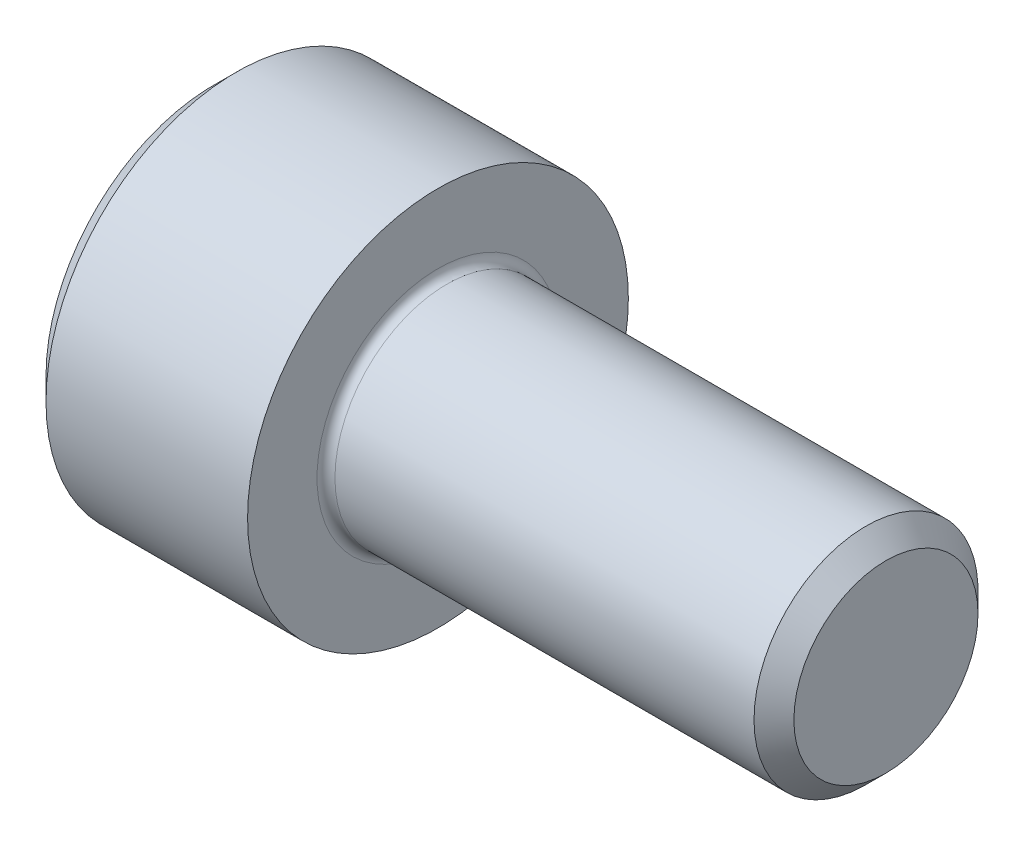
ISO-10303-21;
HEADER;
FILE_DESCRIPTION(('STEP AP214'),'2;1');
FILE_NAME('part.step','',(''),(''),'','','');
FILE_SCHEMA(('AUTOMOTIVE_DESIGN { 1 0 10303 214 1 1 1 1 }'));
ENDSEC;
DATA;
#1=APPLICATION_CONTEXT('core data for automotive mechanical design processes');
#2=APPLICATION_PROTOCOL_DEFINITION('international standard','automotive_design',2000,#1);
#3=PRODUCT_CONTEXT('',#1,'mechanical');
#4=PRODUCT('Part','Part','',(#3));
#5=PRODUCT_RELATED_PRODUCT_CATEGORY('part','',(#4));
#6=PRODUCT_DEFINITION_FORMATION('','',#4);
#7=PRODUCT_DEFINITION_CONTEXT('part definition',#1,'design');
#8=PRODUCT_DEFINITION('design','',#6,#7);
#9=PRODUCT_DEFINITION_SHAPE('','',#8);
#10=(LENGTH_UNIT() NAMED_UNIT(*) SI_UNIT(.MILLI.,.METRE.));
#11=(NAMED_UNIT(*) PLANE_ANGLE_UNIT() SI_UNIT($,.RADIAN.));
#12=(NAMED_UNIT(*) SI_UNIT($,.STERADIAN.) SOLID_ANGLE_UNIT());
#13=UNCERTAINTY_MEASURE_WITH_UNIT(LENGTH_MEASURE(1.E-05),#10,'distance_accuracy_value','');
#14=(GEOMETRIC_REPRESENTATION_CONTEXT(3) GLOBAL_UNCERTAINTY_ASSIGNED_CONTEXT((#13)) GLOBAL_UNIT_ASSIGNED_CONTEXT((#10,
#11,#12)) REPRESENTATION_CONTEXT('',''));
#15=CARTESIAN_POINT('',(0.,0.,0.));
#16=DIRECTION('',(0.,0.,1.));
#17=DIRECTION('',(1.,0.,0.));
#18=AXIS2_PLACEMENT_3D('',#15,#16,#17);
#19=CARTESIAN_POINT('',(0.,0.,0.));
#20=DIRECTION('',(-1.,0.,0.));
#21=DIRECTION('',(0.,0.,1.));
#22=AXIS2_PLACEMENT_3D('',#19,#20,#21);
#23=PLANE('',#22);
#24=DIRECTION('',(0.,-0.5,0.866025403784438));
#25=VECTOR('',#24,1.);
#26=CARTESIAN_POINT('',(0.,2.35789849937043,0.));
#27=LINE('',#26,#25);
#28=CARTESIAN_POINT('',(0.,2.35789849937043,0.));
#29=VERTEX_POINT('',#28);
#30=CARTESIAN_POINT('',(0.,1.17894924968521,2.042));
#31=VERTEX_POINT('',#30);
#32=EDGE_CURVE('E262',#29,#31,#27,.T.);
#33=ORIENTED_EDGE('',*,*,#32,.T.);
#34=DIRECTION('',(0.,1.,0.));
#35=VECTOR('',#34,1.);
#36=CARTESIAN_POINT('',(0.,-1.17894924968522,2.042));
#37=LINE('',#36,#35);
#38=CARTESIAN_POINT('',(0.,-1.17894924968522,2.042));
#39=VERTEX_POINT('',#38);
#40=EDGE_CURVE('E133',#39,#31,#37,.T.);
#41=ORIENTED_EDGE('',*,*,#40,.F.);
#42=DIRECTION('',(0.,-0.500000000000001,-0.866025403784438));
#43=VECTOR('',#42,1.);
#44=CARTESIAN_POINT('',(0.,-1.17894924968522,2.042));
#45=LINE('',#44,#43);
#46=CARTESIAN_POINT('',(0.,-2.35789849937044,0.));
#47=VERTEX_POINT('',#46);
#48=EDGE_CURVE('E265',#39,#47,#45,.T.);
#49=ORIENTED_EDGE('',*,*,#48,.T.);
#50=DIRECTION('',(0.,0.5,-0.866025403784439));
#51=VECTOR('',#50,1.);
#52=CARTESIAN_POINT('',(0.,-2.35789849937044,0.));
#53=LINE('',#52,#51);
#54=CARTESIAN_POINT('',(0.,-1.17894924968522,-2.042));
#55=VERTEX_POINT('',#54);
#56=EDGE_CURVE('E268',#47,#55,#53,.T.);
#57=ORIENTED_EDGE('',*,*,#56,.T.);
#58=DIRECTION('',(0.,-1.,0.));
#59=VECTOR('',#58,1.);
#60=CARTESIAN_POINT('',(0.,1.17894924968521,-2.042));
#61=LINE('',#60,#59);
#62=CARTESIAN_POINT('',(0.,1.17894924968521,-2.042));
#63=VERTEX_POINT('',#62);
#64=EDGE_CURVE('E271',#63,#55,#61,.T.);
#65=ORIENTED_EDGE('',*,*,#64,.F.);
#66=DIRECTION('',(0.,-0.500000000000001,-0.866025403784438));
#67=VECTOR('',#66,1.);
#68=CARTESIAN_POINT('',(0.,2.35789849937043,0.));
#69=LINE('',#68,#67);
#70=EDGE_CURVE('E128',#29,#63,#69,.T.);
#71=ORIENTED_EDGE('',*,*,#70,.F.);
#72=EDGE_LOOP('',(#33,#41,#49,#57,#65,#71));
#73=FACE_BOUND('',#72,.T.);
#74=CARTESIAN_POINT('',(0.,0.,0.));
#75=DIRECTION('',(-1.,0.,0.));
#76=DIRECTION('',(0.,0.,1.));
#77=AXIS2_PLACEMENT_3D('',#74,#75,#76);
#78=CIRCLE('',#77,3.75);
#79=CARTESIAN_POINT('',(0.,0.,3.75));
#80=VERTEX_POINT('',#79);
#81=EDGE_CURVE('E157',#80,#80,#78,.T.);
#82=ORIENTED_EDGE('',*,*,#81,.T.);
#83=EDGE_LOOP('',(#82));
#84=FACE_BOUND('',#83,.T.);
#85=ADVANCED_FACE('F37',(#73,#84),#23,.T.);
#86=CARTESIAN_POINT('',(0.,0.,0.));
#87=DIRECTION('',(1.,0.,0.));
#88=DIRECTION('',(0.,0.,-1.));
#89=AXIS2_PLACEMENT_3D('',#86,#87,#88);
#90=CONICAL_SURFACE('',#89,3.75,0.785398163397449);
#91=CARTESIAN_POINT('',(0.5,0.,0.));
#92=DIRECTION('',(-1.,0.,0.));
#93=DIRECTION('',(0.,0.,1.));
#94=AXIS2_PLACEMENT_3D('',#91,#92,#93);
#95=CIRCLE('',#94,4.25);
#96=CARTESIAN_POINT('',(0.5,0.,4.25));
#97=VERTEX_POINT('',#96);
#98=EDGE_CURVE('E154',#97,#97,#95,.T.);
#99=ORIENTED_EDGE('',*,*,#98,.T.);
#100=EDGE_LOOP('',(#99));
#101=FACE_BOUND('',#100,.T.);
#102=ORIENTED_EDGE('',*,*,#81,.F.);
#103=EDGE_LOOP('',(#102));
#104=FACE_BOUND('',#103,.T.);
#105=ADVANCED_FACE('F178',(#101,#104),#90,.T.);
#106=CARTESIAN_POINT('',(-31.75,0.,0.));
#107=DIRECTION('',(-1.,0.,0.));
#108=DIRECTION('',(0.,0.,1.));
#109=AXIS2_PLACEMENT_3D('',#106,#107,#108);
#110=CYLINDRICAL_SURFACE('',#109,4.25);
#111=CARTESIAN_POINT('',(5.,0.,0.));
#112=DIRECTION('',(-1.,0.,0.));
#113=DIRECTION('',(0.,0.,1.));
#114=AXIS2_PLACEMENT_3D('',#111,#112,#113);
#115=CIRCLE('',#114,4.25);
#116=CARTESIAN_POINT('',(5.,0.,4.25));
#117=VERTEX_POINT('',#116);
#118=EDGE_CURVE('E151',#117,#117,#115,.T.);
#119=ORIENTED_EDGE('',*,*,#118,.T.);
#120=EDGE_LOOP('',(#119));
#121=FACE_BOUND('',#120,.T.);
#122=ORIENTED_EDGE('',*,*,#98,.F.);
#123=EDGE_LOOP('',(#122));
#124=FACE_BOUND('',#123,.T.);
#125=ADVANCED_FACE('F183',(#121,#124),#110,.T.);
#126=CARTESIAN_POINT('',(5.,4.25,0.));
#127=DIRECTION('',(1.,0.,0.));
#128=DIRECTION('',(0.,0.,-1.));
#129=AXIS2_PLACEMENT_3D('',#126,#127,#128);
#130=PLANE('',#129);
#131=CARTESIAN_POINT('',(5.,0.,0.));
#132=DIRECTION('',(1.,0.,0.));
#133=DIRECTION('',(0.,0.,-1.));
#134=AXIS2_PLACEMENT_3D('',#131,#132,#133);
#135=CIRCLE('',#134,2.69999999999997);
#136=CARTESIAN_POINT('',(5.,0.,-2.69999999999997));
#137=VERTEX_POINT('',#136);
#138=EDGE_CURVE('E45',#137,#137,#135,.F.);
#139=ORIENTED_EDGE('',*,*,#138,.T.);
#140=EDGE_LOOP('',(#139));
#141=FACE_BOUND('',#140,.T.);
#142=ORIENTED_EDGE('',*,*,#118,.F.);
#143=EDGE_LOOP('',(#142));
#144=FACE_BOUND('',#143,.T.);
#145=ADVANCED_FACE('F162',(#141,#144),#130,.T.);
#146=CARTESIAN_POINT('',(-31.75,0.,0.));
#147=DIRECTION('',(-1.,0.,0.));
#148=DIRECTION('',(0.,0.,1.));
#149=AXIS2_PLACEMENT_3D('',#146,#147,#148);
#150=CYLINDRICAL_SURFACE('',#149,2.49999999999996);
#151=CARTESIAN_POINT('',(5.2,0.,0.));
#152=DIRECTION('',(1.,0.,0.));
#153=DIRECTION('',(0.,0.,-1.));
#154=AXIS2_PLACEMENT_3D('',#151,#152,#153);
#155=CIRCLE('',#154,2.49999999999996);
#156=CARTESIAN_POINT('',(5.2,0.,-2.49999999999996));
#157=VERTEX_POINT('',#156);
#158=EDGE_CURVE('E11',#157,#157,#155,.T.);
#159=ORIENTED_EDGE('',*,*,#158,.T.);
#160=EDGE_LOOP('',(#159));
#161=FACE_BOUND('',#160,.T.);
#162=CARTESIAN_POINT('',(14.5549999999999,0.,0.));
#163=DIRECTION('',(-1.,0.,0.));
#164=DIRECTION('',(0.,0.,1.));
#165=AXIS2_PLACEMENT_3D('',#162,#163,#164);
#166=CIRCLE('',#165,2.49999999999993);
#167=CARTESIAN_POINT('',(14.5549999999999,0.,2.49999999999993));
#168=VERTEX_POINT('',#167);
#169=EDGE_CURVE('E148',#168,#168,#166,.T.);
#170=ORIENTED_EDGE('',*,*,#169,.T.);
#171=EDGE_LOOP('',(#170));
#172=FACE_BOUND('',#171,.T.);
#173=ADVANCED_FACE('F193',(#161,#172),#150,.T.);
#174=CARTESIAN_POINT('',(15.,0.,0.));
#175=DIRECTION('',(-1.,0.,0.));
#176=DIRECTION('',(0.,0.,1.));
#177=AXIS2_PLACEMENT_3D('',#174,#175,#176);
#178=CONICAL_SURFACE('',#177,2.055,0.785398163397306);
#179=ORIENTED_EDGE('',*,*,#169,.F.);
#180=EDGE_LOOP('',(#179));
#181=FACE_BOUND('',#180,.T.);
#182=CARTESIAN_POINT('',(15.,0.,0.));
#183=DIRECTION('',(-1.,0.,0.));
#184=DIRECTION('',(0.,0.,1.));
#185=AXIS2_PLACEMENT_3D('',#182,#183,#184);
#186=CIRCLE('',#185,2.055);
#187=CARTESIAN_POINT('',(15.,0.,2.055));
#188=VERTEX_POINT('',#187);
#189=EDGE_CURVE('E144',#188,#188,#186,.T.);
#190=ORIENTED_EDGE('',*,*,#189,.T.);
#191=EDGE_LOOP('',(#190));
#192=FACE_BOUND('',#191,.T.);
#193=ADVANCED_FACE('F173',(#181,#192),#178,.T.);
#194=CARTESIAN_POINT('',(15.,2.055,0.));
#195=DIRECTION('',(1.,0.,0.));
#196=DIRECTION('',(0.,0.,-1.));
#197=AXIS2_PLACEMENT_3D('',#194,#195,#196);
#198=PLANE('',#197);
#199=ORIENTED_EDGE('',*,*,#189,.F.);
#200=EDGE_LOOP('',(#199));
#201=FACE_BOUND('',#200,.T.);
#202=ADVANCED_FACE('F166',(#201),#198,.T.);
#203=CARTESIAN_POINT('',(5.2,0.,0.));
#204=DIRECTION('',(1.,0.,0.));
#205=DIRECTION('',(0.,0.,-1.));
#206=AXIS2_PLACEMENT_3D('',#203,#204,#205);
#207=TOROIDAL_SURFACE('',#206,2.69999999999997,0.2);
#208=ORIENTED_EDGE('',*,*,#158,.F.);
#209=EDGE_LOOP('',(#208));
#210=FACE_BOUND('',#209,.T.);
#211=ORIENTED_EDGE('',*,*,#138,.F.);
#212=EDGE_LOOP('',(#211));
#213=FACE_BOUND('',#212,.T.);
#214=ADVANCED_FACE('F39',(#210,#213),#207,.F.);
#215=CARTESIAN_POINT('',(2.5,2.35789849937043,0.));
#216=DIRECTION('',(0.,-0.866025403784439,-0.5));
#217=DIRECTION('',(0.,0.5,-0.866025403784439));
#218=AXIS2_PLACEMENT_3D('',#215,#216,#217);
#219=PLANE('',#218);
#220=ORIENTED_EDGE('',*,*,#32,.F.);
#221=DIRECTION('',(-1.,0.,0.));
#222=VECTOR('',#221,1.);
#223=CARTESIAN_POINT('',(2.5,2.35789849937043,0.));
#224=LINE('',#223,#222);
#225=CARTESIAN_POINT('',(2.5,2.35789849937043,0.));
#226=VERTEX_POINT('',#225);
#227=EDGE_CURVE('E252',#226,#29,#224,.T.);
#228=ORIENTED_EDGE('',*,*,#227,.F.);
#229=DIRECTION('',(0.,-0.5,0.866025403784438));
#230=VECTOR('',#229,1.);
#231=CARTESIAN_POINT('',(2.5,2.35789849937043,0.));
#232=LINE('',#231,#230);
#233=CARTESIAN_POINT('',(2.5,1.76842387452782,1.021));
#234=VERTEX_POINT('',#233);
#235=EDGE_CURVE('E120',#226,#234,#232,.T.);
#236=ORIENTED_EDGE('',*,*,#235,.T.);
#237=CARTESIAN_POINT('',(2.5,1.17894924968521,2.042));
#238=VERTEX_POINT('',#237);
#239=EDGE_CURVE('E111',#234,#238,#232,.T.);
#240=ORIENTED_EDGE('',*,*,#239,.T.);
#241=DIRECTION('',(-1.,0.,0.));
#242=VECTOR('',#241,1.);
#243=CARTESIAN_POINT('',(2.5,1.17894924968521,2.042));
#244=LINE('',#243,#242);
#245=EDGE_CURVE('E125',#238,#31,#244,.T.);
#246=ORIENTED_EDGE('',*,*,#245,.T.);
#247=EDGE_LOOP('',(#220,#228,#236,#240,#246));
#248=FACE_BOUND('',#247,.T.);
#249=ADVANCED_FACE('F124',(#248),#219,.T.);
#250=CARTESIAN_POINT('',(2.5,-1.17894924968522,2.042));
#251=DIRECTION('',(0.,0.,1.));
#252=DIRECTION('',(0.,-1.,0.));
#253=AXIS2_PLACEMENT_3D('',#250,#251,#252);
#254=PLANE('',#253);
#255=ORIENTED_EDGE('',*,*,#40,.T.);
#256=ORIENTED_EDGE('',*,*,#245,.F.);
#257=DIRECTION('',(0.,1.,0.));
#258=VECTOR('',#257,1.);
#259=CARTESIAN_POINT('',(2.5,-1.17894924968522,2.042));
#260=LINE('',#259,#258);
#261=CARTESIAN_POINT('',(2.5,0.,2.042));
#262=VERTEX_POINT('',#261);
#263=EDGE_CURVE('E108',#262,#238,#260,.T.);
#264=ORIENTED_EDGE('',*,*,#263,.F.);
#265=CARTESIAN_POINT('',(2.5,-1.17894924968522,2.042));
#266=VERTEX_POINT('',#265);
#267=EDGE_CURVE('E119',#266,#262,#260,.T.);
#268=ORIENTED_EDGE('',*,*,#267,.F.);
#269=DIRECTION('',(-1.,0.,0.));
#270=VECTOR('',#269,1.);
#271=CARTESIAN_POINT('',(2.5,-1.17894924968522,2.042));
#272=LINE('',#271,#270);
#273=EDGE_CURVE('E135',#266,#39,#272,.T.);
#274=ORIENTED_EDGE('',*,*,#273,.T.);
#275=EDGE_LOOP('',(#255,#256,#264,#268,#274));
#276=FACE_BOUND('',#275,.T.);
#277=ADVANCED_FACE('F130',(#276),#254,.F.);
#278=CARTESIAN_POINT('',(2.5,-1.17894924968522,2.042));
#279=DIRECTION('',(0.,0.866025403784438,-0.500000000000001));
#280=DIRECTION('',(0.,0.500000000000001,0.866025403784438));
#281=AXIS2_PLACEMENT_3D('',#278,#279,#280);
#282=PLANE('',#281);
#283=ORIENTED_EDGE('',*,*,#48,.F.);
#284=ORIENTED_EDGE('',*,*,#273,.F.);
#285=DIRECTION('',(0.,-0.500000000000001,-0.866025403784438));
#286=VECTOR('',#285,1.);
#287=CARTESIAN_POINT('',(2.5,-1.17894924968522,2.042));
#288=LINE('',#287,#286);
#289=CARTESIAN_POINT('',(2.5,-1.76842387452782,1.021));
#290=VERTEX_POINT('',#289);
#291=EDGE_CURVE('E291',#266,#290,#288,.T.);
#292=ORIENTED_EDGE('',*,*,#291,.T.);
#293=CARTESIAN_POINT('',(2.5,-2.35789849937044,0.));
#294=VERTEX_POINT('',#293);
#295=EDGE_CURVE('E280',#290,#294,#288,.T.);
#296=ORIENTED_EDGE('',*,*,#295,.T.);
#297=DIRECTION('',(-1.,0.,0.));
#298=VECTOR('',#297,1.);
#299=CARTESIAN_POINT('',(2.5,-2.35789849937044,0.));
#300=LINE('',#299,#298);
#301=EDGE_CURVE('E140',#294,#47,#300,.T.);
#302=ORIENTED_EDGE('',*,*,#301,.T.);
#303=EDGE_LOOP('',(#283,#284,#292,#296,#302));
#304=FACE_BOUND('',#303,.T.);
#305=ADVANCED_FACE('F206',(#304),#282,.T.);
#306=CARTESIAN_POINT('',(2.5,-2.35789849937044,0.));
#307=DIRECTION('',(0.,0.866025403784439,0.5));
#308=DIRECTION('',(0.,-0.5,0.866025403784439));
#309=AXIS2_PLACEMENT_3D('',#306,#307,#308);
#310=PLANE('',#309);
#311=ORIENTED_EDGE('',*,*,#56,.F.);
#312=ORIENTED_EDGE('',*,*,#301,.F.);
#313=DIRECTION('',(0.,0.5,-0.866025403784439));
#314=VECTOR('',#313,1.);
#315=CARTESIAN_POINT('',(2.5,-2.35789849937044,0.));
#316=LINE('',#315,#314);
#317=CARTESIAN_POINT('',(2.5,-1.76842387452783,-1.021));
#318=VERTEX_POINT('',#317);
#319=EDGE_CURVE('E258',#294,#318,#316,.T.);
#320=ORIENTED_EDGE('',*,*,#319,.T.);
#321=CARTESIAN_POINT('',(2.5,-1.17894924968522,-2.042));
#322=VERTEX_POINT('',#321);
#323=EDGE_CURVE('E290',#318,#322,#316,.T.);
#324=ORIENTED_EDGE('',*,*,#323,.T.);
#325=DIRECTION('',(-1.,0.,0.));
#326=VECTOR('',#325,1.);
#327=CARTESIAN_POINT('',(2.5,-1.17894924968522,-2.042));
#328=LINE('',#327,#326);
#329=EDGE_CURVE('E251',#322,#55,#328,.T.);
#330=ORIENTED_EDGE('',*,*,#329,.T.);
#331=EDGE_LOOP('',(#311,#312,#320,#324,#330));
#332=FACE_BOUND('',#331,.T.);
#333=ADVANCED_FACE('F209',(#332),#310,.T.);
#334=CARTESIAN_POINT('',(2.5,1.17894924968521,-2.042));
#335=DIRECTION('',(0.,0.,-1.));
#336=DIRECTION('',(0.,1.,0.));
#337=AXIS2_PLACEMENT_3D('',#334,#335,#336);
#338=PLANE('',#337);
#339=ORIENTED_EDGE('',*,*,#64,.T.);
#340=ORIENTED_EDGE('',*,*,#329,.F.);
#341=DIRECTION('',(0.,-1.,0.));
#342=VECTOR('',#341,1.);
#343=CARTESIAN_POINT('',(2.5,1.17894924968521,-2.042));
#344=LINE('',#343,#342);
#345=CARTESIAN_POINT('',(2.5,0.,-2.042));
#346=VERTEX_POINT('',#345);
#347=EDGE_CURVE('E255',#346,#322,#344,.T.);
#348=ORIENTED_EDGE('',*,*,#347,.F.);
#349=CARTESIAN_POINT('',(2.5,1.17894924968521,-2.042));
#350=VERTEX_POINT('',#349);
#351=EDGE_CURVE('E52',#350,#346,#344,.T.);
#352=ORIENTED_EDGE('',*,*,#351,.F.);
#353=DIRECTION('',(-1.,0.,0.));
#354=VECTOR('',#353,1.);
#355=CARTESIAN_POINT('',(2.5,1.17894924968521,-2.042));
#356=LINE('',#355,#354);
#357=EDGE_CURVE('E248',#350,#63,#356,.T.);
#358=ORIENTED_EDGE('',*,*,#357,.T.);
#359=EDGE_LOOP('',(#339,#340,#348,#352,#358));
#360=FACE_BOUND('',#359,.T.);
#361=ADVANCED_FACE('F213',(#360),#338,.F.);
#362=CARTESIAN_POINT('',(2.5,2.35789849937043,0.));
#363=DIRECTION('',(0.,0.866025403784438,-0.500000000000001));
#364=DIRECTION('',(0.,0.500000000000001,0.866025403784438));
#365=AXIS2_PLACEMENT_3D('',#362,#363,#364);
#366=PLANE('',#365);
#367=ORIENTED_EDGE('',*,*,#70,.T.);
#368=ORIENTED_EDGE('',*,*,#357,.F.);
#369=DIRECTION('',(0.,-0.500000000000001,-0.866025403784438));
#370=VECTOR('',#369,1.);
#371=CARTESIAN_POINT('',(2.5,2.35789849937043,0.));
#372=LINE('',#371,#370);
#373=CARTESIAN_POINT('',(2.5,1.76842387452782,-1.021));
#374=VERTEX_POINT('',#373);
#375=EDGE_CURVE('E238',#374,#350,#372,.T.);
#376=ORIENTED_EDGE('',*,*,#375,.F.);
#377=EDGE_CURVE('E244',#226,#374,#372,.T.);
#378=ORIENTED_EDGE('',*,*,#377,.F.);
#379=ORIENTED_EDGE('',*,*,#227,.T.);
#380=EDGE_LOOP('',(#367,#368,#376,#378,#379));
#381=FACE_BOUND('',#380,.T.);
#382=ADVANCED_FACE('F217',(#381),#366,.F.);
#383=CARTESIAN_POINT('',(2.5,2.35789849937043,0.));
#384=DIRECTION('',(1.,0.,0.));
#385=DIRECTION('',(0.,0.,-1.));
#386=AXIS2_PLACEMENT_3D('',#383,#384,#385);
#387=PLANE('',#386);
#388=ORIENTED_EDGE('',*,*,#347,.T.);
#389=ORIENTED_EDGE('',*,*,#323,.F.);
#390=CARTESIAN_POINT('',(2.5,0.,0.));
#391=DIRECTION('',(-1.,0.,0.));
#392=DIRECTION('',(0.,0.,1.));
#393=AXIS2_PLACEMENT_3D('',#390,#391,#392);
#394=CIRCLE('',#393,2.042);
#395=EDGE_CURVE('E286',#346,#318,#394,.T.);
#396=ORIENTED_EDGE('',*,*,#395,.F.);
#397=EDGE_LOOP('',(#388,#389,#396));
#398=FACE_BOUND('',#397,.T.);
#399=ADVANCED_FACE('F221',(#398),#387,.F.);
#400=ORIENTED_EDGE('',*,*,#319,.F.);
#401=ORIENTED_EDGE('',*,*,#295,.F.);
#402=EDGE_CURVE('E138',#318,#290,#394,.T.);
#403=ORIENTED_EDGE('',*,*,#402,.F.);
#404=EDGE_LOOP('',(#400,#401,#403));
#405=FACE_BOUND('',#404,.T.);
#406=ADVANCED_FACE('F224',(#405),#387,.F.);
#407=ORIENTED_EDGE('',*,*,#291,.F.);
#408=ORIENTED_EDGE('',*,*,#267,.T.);
#409=EDGE_CURVE('E134',#290,#262,#394,.T.);
#410=ORIENTED_EDGE('',*,*,#409,.F.);
#411=EDGE_LOOP('',(#407,#408,#410));
#412=FACE_BOUND('',#411,.T.);
#413=ADVANCED_FACE('F229',(#412),#387,.F.);
#414=ORIENTED_EDGE('',*,*,#263,.T.);
#415=ORIENTED_EDGE('',*,*,#239,.F.);
#416=EDGE_CURVE('E114',#262,#234,#394,.T.);
#417=ORIENTED_EDGE('',*,*,#416,.F.);
#418=EDGE_LOOP('',(#414,#415,#417));
#419=FACE_BOUND('',#418,.T.);
#420=ADVANCED_FACE('F110',(#419),#387,.F.);
#421=ORIENTED_EDGE('',*,*,#235,.F.);
#422=ORIENTED_EDGE('',*,*,#377,.T.);
#423=EDGE_CURVE('E145',#234,#374,#394,.T.);
#424=ORIENTED_EDGE('',*,*,#423,.F.);
#425=EDGE_LOOP('',(#421,#422,#424));
#426=FACE_BOUND('',#425,.T.);
#427=ADVANCED_FACE('F232',(#426),#387,.F.);
#428=ORIENTED_EDGE('',*,*,#375,.T.);
#429=ORIENTED_EDGE('',*,*,#351,.T.);
#430=EDGE_CURVE('E241',#374,#346,#394,.T.);
#431=ORIENTED_EDGE('',*,*,#430,.F.);
#432=EDGE_LOOP('',(#428,#429,#431));
#433=FACE_BOUND('',#432,.T.);
#434=ADVANCED_FACE('F202',(#433),#387,.F.);
#435=CARTESIAN_POINT('',(2.5,0.,0.));
#436=DIRECTION('',(-1.,0.,0.));
#437=DIRECTION('',(0.,0.,1.));
#438=AXIS2_PLACEMENT_3D('',#435,#436,#437);
#439=CONICAL_SURFACE('',#438,2.042,1.04719755119659);
#440=CARTESIAN_POINT('',(3.67894924968522,0.,0.));
#441=VERTEX_POINT('',#440);
#442=VERTEX_LOOP('',#441);
#443=FACE_BOUND('',#442,.T.);
#444=ORIENTED_EDGE('',*,*,#416,.T.);
#445=ORIENTED_EDGE('',*,*,#423,.T.);
#446=ORIENTED_EDGE('',*,*,#430,.T.);
#447=ORIENTED_EDGE('',*,*,#395,.T.);
#448=ORIENTED_EDGE('',*,*,#402,.T.);
#449=ORIENTED_EDGE('',*,*,#409,.T.);
#450=EDGE_LOOP('',(#444,#445,#446,#447,#448,#449));
#451=FACE_BOUND('',#450,.T.);
#452=ADVANCED_FACE('F200',(#443,#451),#439,.F.);
#453=CLOSED_SHELL('',(#85,#105,#125,#145,#173,#193,#202,#214,#249,#277,#305,#333,#361,#382,#399,
#406,#413,#420,#427,#434,#452));
#454=MANIFOLD_SOLID_BREP('B2',#453);
#455=ADVANCED_BREP_SHAPE_REPRESENTATION('',(#18,#454),#14);
#456=SHAPE_DEFINITION_REPRESENTATION(#9,#455);
ENDSEC;
END-ISO-10303-21;
